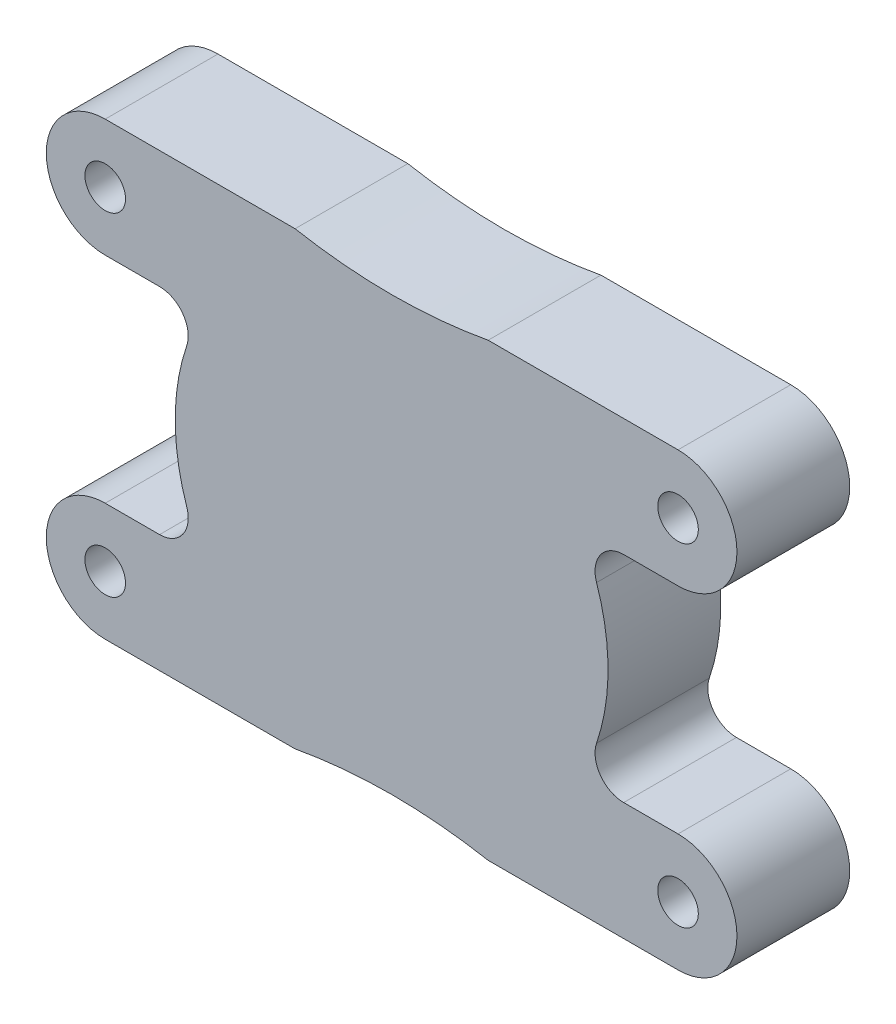
ISO-10303-21;
HEADER;
FILE_DESCRIPTION(('STEP AP214'),'2;1');
FILE_NAME('part.step','',(''),(''),'','','');
FILE_SCHEMA(('AUTOMOTIVE_DESIGN { 1 0 10303 214 1 1 1 1 }'));
ENDSEC;
DATA;
#1=APPLICATION_CONTEXT('core data for automotive mechanical design processes');
#2=APPLICATION_PROTOCOL_DEFINITION('international standard','automotive_design',2000,#1);
#3=PRODUCT_CONTEXT('',#1,'mechanical');
#4=PRODUCT('Part','Part','',(#3));
#5=PRODUCT_RELATED_PRODUCT_CATEGORY('part','',(#4));
#6=PRODUCT_DEFINITION_FORMATION('','',#4);
#7=PRODUCT_DEFINITION_CONTEXT('part definition',#1,'design');
#8=PRODUCT_DEFINITION('design','',#6,#7);
#9=PRODUCT_DEFINITION_SHAPE('','',#8);
#10=(LENGTH_UNIT() NAMED_UNIT(*) SI_UNIT(.MILLI.,.METRE.));
#11=(NAMED_UNIT(*) PLANE_ANGLE_UNIT() SI_UNIT($,.RADIAN.));
#12=(NAMED_UNIT(*) SI_UNIT($,.STERADIAN.) SOLID_ANGLE_UNIT());
#13=UNCERTAINTY_MEASURE_WITH_UNIT(LENGTH_MEASURE(1.E-05),#10,'distance_accuracy_value','');
#14=(GEOMETRIC_REPRESENTATION_CONTEXT(3) GLOBAL_UNCERTAINTY_ASSIGNED_CONTEXT((#13)) GLOBAL_UNIT_ASSIGNED_CONTEXT((#10,
#11,#12)) REPRESENTATION_CONTEXT('',''));
#15=CARTESIAN_POINT('',(0.,0.,0.));
#16=DIRECTION('',(0.,0.,1.));
#17=DIRECTION('',(1.,0.,0.));
#18=AXIS2_PLACEMENT_3D('',#15,#16,#17);
#19=CARTESIAN_POINT('',(0.,-66.4553538573512,10.));
#20=DIRECTION('',(0.,0.,1.));
#21=DIRECTION('',(1.,0.,0.));
#22=AXIS2_PLACEMENT_3D('',#19,#20,#21);
#23=PLANE('',#22);
#24=CARTESIAN_POINT('',(25.4,-14.7499948,10.));
#25=DIRECTION('',(0.,0.,1.));
#26=DIRECTION('',(1.,0.,0.));
#27=AXIS2_PLACEMENT_3D('',#24,#25,#26);
#28=CIRCLE('',#27,1.8);
#29=CARTESIAN_POINT('',(27.2,-14.7499948,10.));
#30=VERTEX_POINT('',#29);
#31=EDGE_CURVE('E460',#30,#30,#28,.T.);
#32=ORIENTED_EDGE('',*,*,#31,.F.);
#33=EDGE_LOOP('',(#32));
#34=FACE_BOUND('',#33,.T.);
#35=CARTESIAN_POINT('',(-25.4,14.7499948,10.));
#36=DIRECTION('',(0.,0.,1.));
#37=DIRECTION('',(1.,0.,0.));
#38=AXIS2_PLACEMENT_3D('',#35,#36,#37);
#39=CIRCLE('',#38,1.8);
#40=CARTESIAN_POINT('',(-23.6,14.7499948,10.));
#41=VERTEX_POINT('',#40);
#42=EDGE_CURVE('E218',#41,#41,#39,.T.);
#43=ORIENTED_EDGE('',*,*,#42,.F.);
#44=EDGE_LOOP('',(#43));
#45=FACE_BOUND('',#44,.T.);
#46=CARTESIAN_POINT('',(0.,-66.4553538573512,10.));
#47=DIRECTION('',(0.,0.,-1.));
#48=DIRECTION('',(1.,0.,0.));
#49=AXIS2_PLACEMENT_3D('',#46,#47,#48);
#50=CIRCLE('',#49,47.2624788573512);
#51=CARTESIAN_POINT('',(-8.56257240819123,-19.9749896,10.));
#52=VERTEX_POINT('',#51);
#53=CARTESIAN_POINT('',(8.56257240819119,-19.9749896,10.));
#54=VERTEX_POINT('',#53);
#55=EDGE_CURVE('E272',#52,#54,#50,.T.);
#56=ORIENTED_EDGE('',*,*,#55,.T.);
#57=DIRECTION('',(1.,0.,0.));
#58=VECTOR('',#57,1.);
#59=CARTESIAN_POINT('',(8.56257240819119,-19.9749896,10.));
#60=LINE('',#59,#58);
#61=CARTESIAN_POINT('',(25.4,-19.9749896,10.));
#62=VERTEX_POINT('',#61);
#63=EDGE_CURVE('E136',#54,#62,#60,.T.);
#64=ORIENTED_EDGE('',*,*,#63,.T.);
#65=CARTESIAN_POINT('',(25.4,-14.7499948,10.));
#66=DIRECTION('',(0.,0.,1.));
#67=DIRECTION('',(1.,0.,0.));
#68=AXIS2_PLACEMENT_3D('',#65,#66,#67);
#69=CIRCLE('',#68,5.2249948);
#70=CARTESIAN_POINT('',(25.4,-9.52500000000001,10.));
#71=VERTEX_POINT('',#70);
#72=EDGE_CURVE('E341',#62,#71,#69,.T.);
#73=ORIENTED_EDGE('',*,*,#72,.T.);
#74=DIRECTION('',(-1.,0.,0.));
#75=VECTOR('',#74,1.);
#76=CARTESIAN_POINT('',(25.4,-9.525,10.));
#77=LINE('',#76,#75);
#78=CARTESIAN_POINT('',(20.5797869465557,-9.525,10.));
#79=VERTEX_POINT('',#78);
#80=EDGE_CURVE('E361',#71,#79,#77,.T.);
#81=ORIENTED_EDGE('',*,*,#80,.T.);
#82=CARTESIAN_POINT('',(20.5797869465557,-6.985,10.));
#83=DIRECTION('',(0.,0.,-1.));
#84=DIRECTION('',(1.,0.,0.));
#85=AXIS2_PLACEMENT_3D('',#82,#83,#84);
#86=CIRCLE('',#85,2.54);
#87=CARTESIAN_POINT('',(18.1745525335178,-6.16863769174581,10.));
#88=VERTEX_POINT('',#87);
#89=EDGE_CURVE('E357',#79,#88,#86,.T.);
#90=ORIENTED_EDGE('',*,*,#89,.T.);
#91=CARTESIAN_POINT('',(0.,0.,10.));
#92=DIRECTION('',(0.,0.,1.));
#93=DIRECTION('',(1.,0.,0.));
#94=AXIS2_PLACEMENT_3D('',#91,#92,#93);
#95=CIRCLE('',#94,19.192875);
#96=CARTESIAN_POINT('',(18.1745525335178,6.16863769174584,10.));
#97=VERTEX_POINT('',#96);
#98=EDGE_CURVE('E360',#88,#97,#95,.T.);
#99=ORIENTED_EDGE('',*,*,#98,.T.);
#100=CARTESIAN_POINT('',(20.5797869465557,6.985,10.));
#101=DIRECTION('',(0.,0.,-1.));
#102=DIRECTION('',(1.,0.,0.));
#103=AXIS2_PLACEMENT_3D('',#100,#101,#102);
#104=CIRCLE('',#103,2.54);
#105=CARTESIAN_POINT('',(20.5797869465555,9.525,10.));
#106=VERTEX_POINT('',#105);
#107=EDGE_CURVE('E365',#97,#106,#104,.T.);
#108=ORIENTED_EDGE('',*,*,#107,.T.);
#109=DIRECTION('',(1.,0.,0.));
#110=VECTOR('',#109,1.);
#111=CARTESIAN_POINT('',(20.5797869465555,9.525,10.));
#112=LINE('',#111,#110);
#113=CARTESIAN_POINT('',(25.4,9.525,10.));
#114=VERTEX_POINT('',#113);
#115=EDGE_CURVE('E372',#106,#114,#112,.T.);
#116=ORIENTED_EDGE('',*,*,#115,.T.);
#117=CARTESIAN_POINT('',(25.4,14.7499948,10.));
#118=DIRECTION('',(0.,0.,1.));
#119=DIRECTION('',(1.,0.,0.));
#120=AXIS2_PLACEMENT_3D('',#117,#118,#119);
#121=CIRCLE('',#120,5.2249948);
#122=CARTESIAN_POINT('',(25.4,19.9749896,10.));
#123=VERTEX_POINT('',#122);
#124=EDGE_CURVE('E375',#114,#123,#121,.T.);
#125=ORIENTED_EDGE('',*,*,#124,.T.);
#126=DIRECTION('',(-1.,0.,0.));
#127=VECTOR('',#126,1.);
#128=CARTESIAN_POINT('',(25.4,19.9749896,10.));
#129=LINE('',#128,#127);
#130=CARTESIAN_POINT('',(8.56257240819117,19.9749896,10.));
#131=VERTEX_POINT('',#130);
#132=EDGE_CURVE('E378',#123,#131,#129,.T.);
#133=ORIENTED_EDGE('',*,*,#132,.T.);
#134=CARTESIAN_POINT('',(0.,66.4553538573512,10.));
#135=DIRECTION('',(0.,0.,-1.));
#136=DIRECTION('',(1.,0.,0.));
#137=AXIS2_PLACEMENT_3D('',#134,#135,#136);
#138=CIRCLE('',#137,47.2624788573512);
#139=CARTESIAN_POINT('',(-8.56257240819127,19.9749896,10.));
#140=VERTEX_POINT('',#139);
#141=EDGE_CURVE('E381',#131,#140,#138,.T.);
#142=ORIENTED_EDGE('',*,*,#141,.T.);
#143=DIRECTION('',(-1.,0.,0.));
#144=VECTOR('',#143,1.);
#145=CARTESIAN_POINT('',(-8.56257240819123,19.9749896,10.));
#146=LINE('',#145,#144);
#147=CARTESIAN_POINT('',(-25.4,19.9749896,10.));
#148=VERTEX_POINT('',#147);
#149=EDGE_CURVE('E384',#140,#148,#146,.T.);
#150=ORIENTED_EDGE('',*,*,#149,.T.);
#151=CARTESIAN_POINT('',(-25.4,14.7499948,10.));
#152=DIRECTION('',(0.,0.,1.));
#153=DIRECTION('',(1.,0.,0.));
#154=AXIS2_PLACEMENT_3D('',#151,#152,#153);
#155=CIRCLE('',#154,5.2249948);
#156=CARTESIAN_POINT('',(-25.4,9.525,10.));
#157=VERTEX_POINT('',#156);
#158=EDGE_CURVE('E387',#148,#157,#155,.T.);
#159=ORIENTED_EDGE('',*,*,#158,.T.);
#160=DIRECTION('',(1.,0.,0.));
#161=VECTOR('',#160,1.);
#162=CARTESIAN_POINT('',(-25.4,9.525,10.));
#163=LINE('',#162,#161);
#164=CARTESIAN_POINT('',(-20.5797869465555,9.525,10.));
#165=VERTEX_POINT('',#164);
#166=EDGE_CURVE('E390',#157,#165,#163,.T.);
#167=ORIENTED_EDGE('',*,*,#166,.T.);
#168=CARTESIAN_POINT('',(-20.5797869465557,6.985,10.));
#169=DIRECTION('',(0.,0.,-1.));
#170=DIRECTION('',(1.,0.,0.));
#171=AXIS2_PLACEMENT_3D('',#168,#169,#170);
#172=CIRCLE('',#171,2.54);
#173=CARTESIAN_POINT('',(-18.1745525335178,6.1686376917458,10.));
#174=VERTEX_POINT('',#173);
#175=EDGE_CURVE('E393',#165,#174,#172,.T.);
#176=ORIENTED_EDGE('',*,*,#175,.T.);
#177=CARTESIAN_POINT('',(0.,0.,10.));
#178=DIRECTION('',(0.,0.,1.));
#179=DIRECTION('',(1.,0.,0.));
#180=AXIS2_PLACEMENT_3D('',#177,#178,#179);
#181=CIRCLE('',#180,19.192875);
#182=CARTESIAN_POINT('',(-18.1745525335178,-6.16863769174583,10.));
#183=VERTEX_POINT('',#182);
#184=EDGE_CURVE('E396',#174,#183,#181,.T.);
#185=ORIENTED_EDGE('',*,*,#184,.T.);
#186=CARTESIAN_POINT('',(-20.5797869465557,-6.985,10.));
#187=DIRECTION('',(0.,0.,-1.));
#188=DIRECTION('',(1.,0.,0.));
#189=AXIS2_PLACEMENT_3D('',#186,#187,#188);
#190=CIRCLE('',#189,2.54);
#191=CARTESIAN_POINT('',(-20.5797869465557,-9.525,10.));
#192=VERTEX_POINT('',#191);
#193=EDGE_CURVE('E191',#183,#192,#190,.T.);
#194=ORIENTED_EDGE('',*,*,#193,.T.);
#195=DIRECTION('',(-1.,0.,0.));
#196=VECTOR('',#195,1.);
#197=CARTESIAN_POINT('',(-20.5797869465557,-9.525,10.));
#198=LINE('',#197,#196);
#199=CARTESIAN_POINT('',(-25.4,-9.52500000000001,10.));
#200=VERTEX_POINT('',#199);
#201=EDGE_CURVE('E185',#192,#200,#198,.T.);
#202=ORIENTED_EDGE('',*,*,#201,.T.);
#203=CARTESIAN_POINT('',(-25.4,-14.7499948,10.));
#204=DIRECTION('',(0.,0.,1.));
#205=DIRECTION('',(1.,0.,0.));
#206=AXIS2_PLACEMENT_3D('',#203,#204,#205);
#207=CIRCLE('',#206,5.2249948);
#208=CARTESIAN_POINT('',(-25.4,-19.9749896,10.));
#209=VERTEX_POINT('',#208);
#210=EDGE_CURVE('E189',#200,#209,#207,.T.);
#211=ORIENTED_EDGE('',*,*,#210,.T.);
#212=DIRECTION('',(1.,0.,0.));
#213=VECTOR('',#212,1.);
#214=CARTESIAN_POINT('',(-25.4,-19.9749896,10.));
#215=LINE('',#214,#213);
#216=EDGE_CURVE('E57',#209,#52,#215,.T.);
#217=ORIENTED_EDGE('',*,*,#216,.T.);
#218=EDGE_LOOP('',(#56,#64,#73,#81,#90,#99,#108,#116,#125,#133,#142,#150,#159,#167,#176,#185,
#194,#202,#211,#217));
#219=FACE_BOUND('',#218,.T.);
#220=CARTESIAN_POINT('',(-25.4,-14.7499948,10.));
#221=DIRECTION('',(0.,0.,1.));
#222=DIRECTION('',(1.,0.,0.));
#223=AXIS2_PLACEMENT_3D('',#220,#221,#222);
#224=CIRCLE('',#223,1.8);
#225=CARTESIAN_POINT('',(-23.6,-14.7499948,10.));
#226=VERTEX_POINT('',#225);
#227=EDGE_CURVE('E468',#226,#226,#224,.T.);
#228=ORIENTED_EDGE('',*,*,#227,.F.);
#229=EDGE_LOOP('',(#228));
#230=FACE_BOUND('',#229,.T.);
#231=CARTESIAN_POINT('',(25.4,14.7499948,10.));
#232=DIRECTION('',(0.,0.,1.));
#233=DIRECTION('',(1.,0.,0.));
#234=AXIS2_PLACEMENT_3D('',#231,#232,#233);
#235=CIRCLE('',#234,1.8);
#236=CARTESIAN_POINT('',(27.2,14.7499948,10.));
#237=VERTEX_POINT('',#236);
#238=EDGE_CURVE('E449',#237,#237,#235,.T.);
#239=ORIENTED_EDGE('',*,*,#238,.F.);
#240=EDGE_LOOP('',(#239));
#241=FACE_BOUND('',#240,.T.);
#242=ADVANCED_FACE('F39',(#34,#45,#219,#230,#241),#23,.T.);
#243=CARTESIAN_POINT('',(0.,-66.4553538573512,0.));
#244=DIRECTION('',(0.,0.,1.));
#245=DIRECTION('',(1.,0.,0.));
#246=AXIS2_PLACEMENT_3D('',#243,#244,#245);
#247=PLANE('',#246);
#248=CARTESIAN_POINT('',(0.,-66.4553538573512,0.));
#249=DIRECTION('',(0.,0.,-1.));
#250=DIRECTION('',(1.,0.,0.));
#251=AXIS2_PLACEMENT_3D('',#248,#249,#250);
#252=CIRCLE('',#251,47.2624788573512);
#253=CARTESIAN_POINT('',(-8.56257240819123,-19.9749896,0.));
#254=VERTEX_POINT('',#253);
#255=CARTESIAN_POINT('',(8.56257240819119,-19.9749896,0.));
#256=VERTEX_POINT('',#255);
#257=EDGE_CURVE('E213',#254,#256,#252,.T.);
#258=ORIENTED_EDGE('',*,*,#257,.F.);
#259=DIRECTION('',(1.,0.,0.));
#260=VECTOR('',#259,1.);
#261=CARTESIAN_POINT('',(-25.4,-19.9749896,0.));
#262=LINE('',#261,#260);
#263=CARTESIAN_POINT('',(-25.4,-19.9749896,0.));
#264=VERTEX_POINT('',#263);
#265=EDGE_CURVE('E128',#264,#254,#262,.T.);
#266=ORIENTED_EDGE('',*,*,#265,.F.);
#267=CARTESIAN_POINT('',(-25.4,-14.7499948,0.));
#268=DIRECTION('',(0.,0.,1.));
#269=DIRECTION('',(1.,0.,0.));
#270=AXIS2_PLACEMENT_3D('',#267,#268,#269);
#271=CIRCLE('',#270,5.2249948);
#272=CARTESIAN_POINT('',(-25.4,-9.52500000000001,0.));
#273=VERTEX_POINT('',#272);
#274=EDGE_CURVE('E122',#273,#264,#271,.T.);
#275=ORIENTED_EDGE('',*,*,#274,.F.);
#276=DIRECTION('',(-1.,0.,0.));
#277=VECTOR('',#276,1.);
#278=CARTESIAN_POINT('',(-20.5797869465557,-9.525,0.));
#279=LINE('',#278,#277);
#280=CARTESIAN_POINT('',(-20.5797869465557,-9.525,0.));
#281=VERTEX_POINT('',#280);
#282=EDGE_CURVE('E200',#281,#273,#279,.T.);
#283=ORIENTED_EDGE('',*,*,#282,.F.);
#284=CARTESIAN_POINT('',(-20.5797869465557,-6.985,0.));
#285=DIRECTION('',(0.,0.,-1.));
#286=DIRECTION('',(1.,0.,0.));
#287=AXIS2_PLACEMENT_3D('',#284,#285,#286);
#288=CIRCLE('',#287,2.54);
#289=CARTESIAN_POINT('',(-18.1745525335178,-6.16863769174583,0.));
#290=VERTEX_POINT('',#289);
#291=EDGE_CURVE('E263',#290,#281,#288,.T.);
#292=ORIENTED_EDGE('',*,*,#291,.F.);
#293=CARTESIAN_POINT('',(0.,0.,0.));
#294=DIRECTION('',(0.,0.,1.));
#295=DIRECTION('',(1.,0.,0.));
#296=AXIS2_PLACEMENT_3D('',#293,#294,#295);
#297=CIRCLE('',#296,19.192875);
#298=CARTESIAN_POINT('',(-18.1745525335178,6.1686376917458,0.));
#299=VERTEX_POINT('',#298);
#300=EDGE_CURVE('E260',#299,#290,#297,.T.);
#301=ORIENTED_EDGE('',*,*,#300,.F.);
#302=CARTESIAN_POINT('',(-20.5797869465557,6.985,0.));
#303=DIRECTION('',(0.,0.,-1.));
#304=DIRECTION('',(1.,0.,0.));
#305=AXIS2_PLACEMENT_3D('',#302,#303,#304);
#306=CIRCLE('',#305,2.54);
#307=CARTESIAN_POINT('',(-20.5797869465555,9.525,0.));
#308=VERTEX_POINT('',#307);
#309=EDGE_CURVE('E257',#308,#299,#306,.T.);
#310=ORIENTED_EDGE('',*,*,#309,.F.);
#311=DIRECTION('',(1.,0.,0.));
#312=VECTOR('',#311,1.);
#313=CARTESIAN_POINT('',(-25.4,9.525,0.));
#314=LINE('',#313,#312);
#315=CARTESIAN_POINT('',(-25.4,9.525,0.));
#316=VERTEX_POINT('',#315);
#317=EDGE_CURVE('E254',#316,#308,#314,.T.);
#318=ORIENTED_EDGE('',*,*,#317,.F.);
#319=CARTESIAN_POINT('',(-25.4,14.7499948,0.));
#320=DIRECTION('',(0.,0.,1.));
#321=DIRECTION('',(1.,0.,0.));
#322=AXIS2_PLACEMENT_3D('',#319,#320,#321);
#323=CIRCLE('',#322,5.2249948);
#324=CARTESIAN_POINT('',(-25.4,19.9749896,0.));
#325=VERTEX_POINT('',#324);
#326=EDGE_CURVE('E251',#325,#316,#323,.T.);
#327=ORIENTED_EDGE('',*,*,#326,.F.);
#328=DIRECTION('',(-1.,0.,0.));
#329=VECTOR('',#328,1.);
#330=CARTESIAN_POINT('',(-8.56257240819123,19.9749896,0.));
#331=LINE('',#330,#329);
#332=CARTESIAN_POINT('',(-8.56257240819127,19.9749896,0.));
#333=VERTEX_POINT('',#332);
#334=EDGE_CURVE('E248',#333,#325,#331,.T.);
#335=ORIENTED_EDGE('',*,*,#334,.F.);
#336=CARTESIAN_POINT('',(0.,66.4553538573512,0.));
#337=DIRECTION('',(0.,0.,-1.));
#338=DIRECTION('',(1.,0.,0.));
#339=AXIS2_PLACEMENT_3D('',#336,#337,#338);
#340=CIRCLE('',#339,47.2624788573512);
#341=CARTESIAN_POINT('',(8.56257240819117,19.9749896,0.));
#342=VERTEX_POINT('',#341);
#343=EDGE_CURVE('E245',#342,#333,#340,.T.);
#344=ORIENTED_EDGE('',*,*,#343,.F.);
#345=DIRECTION('',(-1.,0.,0.));
#346=VECTOR('',#345,1.);
#347=CARTESIAN_POINT('',(25.4,19.9749896,0.));
#348=LINE('',#347,#346);
#349=CARTESIAN_POINT('',(25.4,19.9749896,0.));
#350=VERTEX_POINT('',#349);
#351=EDGE_CURVE('E242',#350,#342,#348,.T.);
#352=ORIENTED_EDGE('',*,*,#351,.F.);
#353=CARTESIAN_POINT('',(25.4,14.7499948,0.));
#354=DIRECTION('',(0.,0.,1.));
#355=DIRECTION('',(1.,0.,0.));
#356=AXIS2_PLACEMENT_3D('',#353,#354,#355);
#357=CIRCLE('',#356,5.2249948);
#358=CARTESIAN_POINT('',(25.4,9.525,0.));
#359=VERTEX_POINT('',#358);
#360=EDGE_CURVE('E239',#359,#350,#357,.T.);
#361=ORIENTED_EDGE('',*,*,#360,.F.);
#362=DIRECTION('',(1.,0.,0.));
#363=VECTOR('',#362,1.);
#364=CARTESIAN_POINT('',(20.5797869465555,9.525,0.));
#365=LINE('',#364,#363);
#366=CARTESIAN_POINT('',(20.5797869465555,9.525,0.));
#367=VERTEX_POINT('',#366);
#368=EDGE_CURVE('E236',#367,#359,#365,.T.);
#369=ORIENTED_EDGE('',*,*,#368,.F.);
#370=CARTESIAN_POINT('',(20.5797869465557,6.985,0.));
#371=DIRECTION('',(0.,0.,-1.));
#372=DIRECTION('',(1.,0.,0.));
#373=AXIS2_PLACEMENT_3D('',#370,#371,#372);
#374=CIRCLE('',#373,2.54);
#375=CARTESIAN_POINT('',(18.1745525335178,6.16863769174584,0.));
#376=VERTEX_POINT('',#375);
#377=EDGE_CURVE('E233',#376,#367,#374,.T.);
#378=ORIENTED_EDGE('',*,*,#377,.F.);
#379=CARTESIAN_POINT('',(0.,0.,0.));
#380=DIRECTION('',(0.,0.,1.));
#381=DIRECTION('',(1.,0.,0.));
#382=AXIS2_PLACEMENT_3D('',#379,#380,#381);
#383=CIRCLE('',#382,19.192875);
#384=CARTESIAN_POINT('',(18.1745525335178,-6.16863769174581,0.));
#385=VERTEX_POINT('',#384);
#386=EDGE_CURVE('E230',#385,#376,#383,.T.);
#387=ORIENTED_EDGE('',*,*,#386,.F.);
#388=CARTESIAN_POINT('',(20.5797869465557,-6.985,0.));
#389=DIRECTION('',(0.,0.,-1.));
#390=DIRECTION('',(1.,0.,0.));
#391=AXIS2_PLACEMENT_3D('',#388,#389,#390);
#392=CIRCLE('',#391,2.54);
#393=CARTESIAN_POINT('',(20.5797869465557,-9.525,0.));
#394=VERTEX_POINT('',#393);
#395=EDGE_CURVE('E227',#394,#385,#392,.T.);
#396=ORIENTED_EDGE('',*,*,#395,.F.);
#397=DIRECTION('',(-1.,0.,0.));
#398=VECTOR('',#397,1.);
#399=CARTESIAN_POINT('',(25.4,-9.525,0.));
#400=LINE('',#399,#398);
#401=CARTESIAN_POINT('',(25.4,-9.52500000000001,0.));
#402=VERTEX_POINT('',#401);
#403=EDGE_CURVE('E224',#402,#394,#400,.T.);
#404=ORIENTED_EDGE('',*,*,#403,.F.);
#405=CARTESIAN_POINT('',(25.4,-14.7499948,0.));
#406=DIRECTION('',(0.,0.,1.));
#407=DIRECTION('',(1.,0.,0.));
#408=AXIS2_PLACEMENT_3D('',#405,#406,#407);
#409=CIRCLE('',#408,5.2249948);
#410=CARTESIAN_POINT('',(25.4,-19.9749896,0.));
#411=VERTEX_POINT('',#410);
#412=EDGE_CURVE('E221',#411,#402,#409,.T.);
#413=ORIENTED_EDGE('',*,*,#412,.F.);
#414=DIRECTION('',(1.,0.,0.));
#415=VECTOR('',#414,1.);
#416=CARTESIAN_POINT('',(8.56257240819119,-19.9749896,0.));
#417=LINE('',#416,#415);
#418=EDGE_CURVE('E217',#256,#411,#417,.T.);
#419=ORIENTED_EDGE('',*,*,#418,.F.);
#420=EDGE_LOOP('',(#258,#266,#275,#283,#292,#301,#310,#318,#327,#335,#344,#352,#361,#369,#378,
#387,#396,#404,#413,#419));
#421=FACE_BOUND('',#420,.T.);
#422=CARTESIAN_POINT('',(-25.4,14.7499948,0.));
#423=DIRECTION('',(0.,0.,1.));
#424=DIRECTION('',(1.,0.,0.));
#425=AXIS2_PLACEMENT_3D('',#422,#423,#424);
#426=CIRCLE('',#425,1.8);
#427=CARTESIAN_POINT('',(-23.6,14.7499948,0.));
#428=VERTEX_POINT('',#427);
#429=EDGE_CURVE('E472',#428,#428,#426,.T.);
#430=ORIENTED_EDGE('',*,*,#429,.T.);
#431=EDGE_LOOP('',(#430));
#432=FACE_BOUND('',#431,.T.);
#433=CARTESIAN_POINT('',(-25.4,-14.7499948,0.));
#434=DIRECTION('',(0.,0.,1.));
#435=DIRECTION('',(1.,0.,0.));
#436=AXIS2_PLACEMENT_3D('',#433,#434,#435);
#437=CIRCLE('',#436,1.8);
#438=CARTESIAN_POINT('',(-23.6,-14.7499948,0.));
#439=VERTEX_POINT('',#438);
#440=EDGE_CURVE('E464',#439,#439,#437,.T.);
#441=ORIENTED_EDGE('',*,*,#440,.T.);
#442=EDGE_LOOP('',(#441));
#443=FACE_BOUND('',#442,.T.);
#444=CARTESIAN_POINT('',(25.4,-14.7499948,0.));
#445=DIRECTION('',(0.,0.,1.));
#446=DIRECTION('',(1.,0.,0.));
#447=AXIS2_PLACEMENT_3D('',#444,#445,#446);
#448=CIRCLE('',#447,1.8);
#449=CARTESIAN_POINT('',(27.2,-14.7499948,0.));
#450=VERTEX_POINT('',#449);
#451=EDGE_CURVE('E457',#450,#450,#448,.T.);
#452=ORIENTED_EDGE('',*,*,#451,.T.);
#453=EDGE_LOOP('',(#452));
#454=FACE_BOUND('',#453,.T.);
#455=CARTESIAN_POINT('',(25.4,14.7499948,0.));
#456=DIRECTION('',(0.,0.,1.));
#457=DIRECTION('',(1.,0.,0.));
#458=AXIS2_PLACEMENT_3D('',#455,#456,#457);
#459=CIRCLE('',#458,1.8);
#460=CARTESIAN_POINT('',(27.2,14.7499948,0.));
#461=VERTEX_POINT('',#460);
#462=EDGE_CURVE('E452',#461,#461,#459,.T.);
#463=ORIENTED_EDGE('',*,*,#462,.T.);
#464=EDGE_LOOP('',(#463));
#465=FACE_BOUND('',#464,.T.);
#466=ADVANCED_FACE('F345',(#421,#432,#443,#454,#465),#247,.F.);
#467=CARTESIAN_POINT('',(0.,-66.4553538573512,10.));
#468=DIRECTION('',(0.,0.,-1.));
#469=DIRECTION('',(-1.,0.,0.));
#470=AXIS2_PLACEMENT_3D('',#467,#468,#469);
#471=CYLINDRICAL_SURFACE('',#470,47.2624788573512);
#472=ORIENTED_EDGE('',*,*,#257,.T.);
#473=DIRECTION('',(0.,0.,-1.));
#474=VECTOR('',#473,1.);
#475=CARTESIAN_POINT('',(8.56257240819119,-19.9749896,10.));
#476=LINE('',#475,#474);
#477=EDGE_CURVE('E11',#54,#256,#476,.T.);
#478=ORIENTED_EDGE('',*,*,#477,.F.);
#479=ORIENTED_EDGE('',*,*,#55,.F.);
#480=DIRECTION('',(0.,0.,-1.));
#481=VECTOR('',#480,1.);
#482=CARTESIAN_POINT('',(-8.56257240819123,-19.9749896,10.));
#483=LINE('',#482,#481);
#484=EDGE_CURVE('E209',#52,#254,#483,.T.);
#485=ORIENTED_EDGE('',*,*,#484,.T.);
#486=EDGE_LOOP('',(#472,#478,#479,#485));
#487=FACE_BOUND('',#486,.T.);
#488=ADVANCED_FACE('F41',(#487),#471,.F.);
#489=CARTESIAN_POINT('',(8.56257240819119,-19.9749896,10.));
#490=DIRECTION('',(0.,1.,0.));
#491=DIRECTION('',(-1.,0.,0.));
#492=AXIS2_PLACEMENT_3D('',#489,#490,#491);
#493=PLANE('',#492);
#494=ORIENTED_EDGE('',*,*,#418,.T.);
#495=DIRECTION('',(0.,0.,-1.));
#496=VECTOR('',#495,1.);
#497=CARTESIAN_POINT('',(25.4,-19.9749896,10.));
#498=LINE('',#497,#496);
#499=EDGE_CURVE('E49',#62,#411,#498,.T.);
#500=ORIENTED_EDGE('',*,*,#499,.F.);
#501=ORIENTED_EDGE('',*,*,#63,.F.);
#502=ORIENTED_EDGE('',*,*,#477,.T.);
#503=EDGE_LOOP('',(#494,#500,#501,#502));
#504=FACE_BOUND('',#503,.T.);
#505=ADVANCED_FACE('F668',(#504),#493,.F.);
#506=CARTESIAN_POINT('',(25.4,-14.7499948,10.));
#507=DIRECTION('',(0.,0.,-1.));
#508=DIRECTION('',(-1.,0.,0.));
#509=AXIS2_PLACEMENT_3D('',#506,#507,#508);
#510=CYLINDRICAL_SURFACE('',#509,5.2249948);
#511=ORIENTED_EDGE('',*,*,#412,.T.);
#512=DIRECTION('',(0.,0.,-1.));
#513=VECTOR('',#512,1.);
#514=CARTESIAN_POINT('',(25.4,-9.52500000000001,10.));
#515=LINE('',#514,#513);
#516=EDGE_CURVE('E331',#71,#402,#515,.T.);
#517=ORIENTED_EDGE('',*,*,#516,.F.);
#518=ORIENTED_EDGE('',*,*,#72,.F.);
#519=ORIENTED_EDGE('',*,*,#499,.T.);
#520=EDGE_LOOP('',(#511,#517,#518,#519));
#521=FACE_BOUND('',#520,.T.);
#522=ADVANCED_FACE('F339',(#521),#510,.T.);
#523=CARTESIAN_POINT('',(25.4,-9.525,10.));
#524=DIRECTION('',(0.,-1.,0.));
#525=DIRECTION('',(1.,0.,0.));
#526=AXIS2_PLACEMENT_3D('',#523,#524,#525);
#527=PLANE('',#526);
#528=ORIENTED_EDGE('',*,*,#403,.T.);
#529=DIRECTION('',(0.,0.,-1.));
#530=VECTOR('',#529,1.);
#531=CARTESIAN_POINT('',(20.5797869465557,-9.525,10.));
#532=LINE('',#531,#530);
#533=EDGE_CURVE('E327',#79,#394,#532,.T.);
#534=ORIENTED_EDGE('',*,*,#533,.F.);
#535=ORIENTED_EDGE('',*,*,#80,.F.);
#536=ORIENTED_EDGE('',*,*,#516,.T.);
#537=EDGE_LOOP('',(#528,#534,#535,#536));
#538=FACE_BOUND('',#537,.T.);
#539=ADVANCED_FACE('F351',(#538),#527,.F.);
#540=CARTESIAN_POINT('',(20.5797869465557,-6.985,10.));
#541=DIRECTION('',(0.,0.,-1.));
#542=DIRECTION('',(-1.,0.,0.));
#543=AXIS2_PLACEMENT_3D('',#540,#541,#542);
#544=CYLINDRICAL_SURFACE('',#543,2.54);
#545=ORIENTED_EDGE('',*,*,#395,.T.);
#546=DIRECTION('',(0.,0.,-1.));
#547=VECTOR('',#546,1.);
#548=CARTESIAN_POINT('',(18.1745525335178,-6.16863769174581,10.));
#549=LINE('',#548,#547);
#550=EDGE_CURVE('E323',#88,#385,#549,.T.);
#551=ORIENTED_EDGE('',*,*,#550,.F.);
#552=ORIENTED_EDGE('',*,*,#89,.F.);
#553=ORIENTED_EDGE('',*,*,#533,.T.);
#554=EDGE_LOOP('',(#545,#551,#552,#553));
#555=FACE_BOUND('',#554,.T.);
#556=ADVANCED_FACE('F355',(#555),#544,.F.);
#557=CARTESIAN_POINT('',(0.,0.,10.));
#558=DIRECTION('',(0.,0.,-1.));
#559=DIRECTION('',(-1.,0.,0.));
#560=AXIS2_PLACEMENT_3D('',#557,#558,#559);
#561=CYLINDRICAL_SURFACE('',#560,19.192875);
#562=ORIENTED_EDGE('',*,*,#386,.T.);
#563=DIRECTION('',(0.,0.,-1.));
#564=VECTOR('',#563,1.);
#565=CARTESIAN_POINT('',(18.1745525335178,6.16863769174584,10.));
#566=LINE('',#565,#564);
#567=EDGE_CURVE('E319',#97,#376,#566,.T.);
#568=ORIENTED_EDGE('',*,*,#567,.F.);
#569=ORIENTED_EDGE('',*,*,#98,.F.);
#570=ORIENTED_EDGE('',*,*,#550,.T.);
#571=EDGE_LOOP('',(#562,#568,#569,#570));
#572=FACE_BOUND('',#571,.T.);
#573=ADVANCED_FACE('F633',(#572),#561,.T.);
#574=CARTESIAN_POINT('',(20.5797869465557,6.985,10.));
#575=DIRECTION('',(0.,0.,-1.));
#576=DIRECTION('',(-1.,0.,0.));
#577=AXIS2_PLACEMENT_3D('',#574,#575,#576);
#578=CYLINDRICAL_SURFACE('',#577,2.54);
#579=ORIENTED_EDGE('',*,*,#377,.T.);
#580=DIRECTION('',(0.,0.,-1.));
#581=VECTOR('',#580,1.);
#582=CARTESIAN_POINT('',(20.5797869465555,9.525,10.));
#583=LINE('',#582,#581);
#584=EDGE_CURVE('E315',#106,#367,#583,.T.);
#585=ORIENTED_EDGE('',*,*,#584,.F.);
#586=ORIENTED_EDGE('',*,*,#107,.F.);
#587=ORIENTED_EDGE('',*,*,#567,.T.);
#588=EDGE_LOOP('',(#579,#585,#586,#587));
#589=FACE_BOUND('',#588,.T.);
#590=ADVANCED_FACE('F623',(#589),#578,.F.);
#591=CARTESIAN_POINT('',(20.5797869465555,9.525,10.));
#592=DIRECTION('',(0.,1.,0.));
#593=DIRECTION('',(-1.,0.,0.));
#594=AXIS2_PLACEMENT_3D('',#591,#592,#593);
#595=PLANE('',#594);
#596=ORIENTED_EDGE('',*,*,#368,.T.);
#597=DIRECTION('',(0.,0.,-1.));
#598=VECTOR('',#597,1.);
#599=CARTESIAN_POINT('',(25.4,9.525,10.));
#600=LINE('',#599,#598);
#601=EDGE_CURVE('E311',#114,#359,#600,.T.);
#602=ORIENTED_EDGE('',*,*,#601,.F.);
#603=ORIENTED_EDGE('',*,*,#115,.F.);
#604=ORIENTED_EDGE('',*,*,#584,.T.);
#605=EDGE_LOOP('',(#596,#602,#603,#604));
#606=FACE_BOUND('',#605,.T.);
#607=ADVANCED_FACE('F613',(#606),#595,.F.);
#608=CARTESIAN_POINT('',(25.4,14.7499948,10.));
#609=DIRECTION('',(0.,0.,-1.));
#610=DIRECTION('',(-1.,0.,0.));
#611=AXIS2_PLACEMENT_3D('',#608,#609,#610);
#612=CYLINDRICAL_SURFACE('',#611,5.2249948);
#613=ORIENTED_EDGE('',*,*,#360,.T.);
#614=DIRECTION('',(0.,0.,-1.));
#615=VECTOR('',#614,1.);
#616=CARTESIAN_POINT('',(25.4,19.9749896,10.));
#617=LINE('',#616,#615);
#618=EDGE_CURVE('E307',#123,#350,#617,.T.);
#619=ORIENTED_EDGE('',*,*,#618,.F.);
#620=ORIENTED_EDGE('',*,*,#124,.F.);
#621=ORIENTED_EDGE('',*,*,#601,.T.);
#622=EDGE_LOOP('',(#613,#619,#620,#621));
#623=FACE_BOUND('',#622,.T.);
#624=ADVANCED_FACE('F603',(#623),#612,.T.);
#625=CARTESIAN_POINT('',(25.4,19.9749896,10.));
#626=DIRECTION('',(0.,-1.,0.));
#627=DIRECTION('',(1.,0.,0.));
#628=AXIS2_PLACEMENT_3D('',#625,#626,#627);
#629=PLANE('',#628);
#630=ORIENTED_EDGE('',*,*,#351,.T.);
#631=DIRECTION('',(0.,0.,-1.));
#632=VECTOR('',#631,1.);
#633=CARTESIAN_POINT('',(8.56257240819117,19.9749896,10.));
#634=LINE('',#633,#632);
#635=EDGE_CURVE('E303',#131,#342,#634,.T.);
#636=ORIENTED_EDGE('',*,*,#635,.F.);
#637=ORIENTED_EDGE('',*,*,#132,.F.);
#638=ORIENTED_EDGE('',*,*,#618,.T.);
#639=EDGE_LOOP('',(#630,#636,#637,#638));
#640=FACE_BOUND('',#639,.T.);
#641=ADVANCED_FACE('F593',(#640),#629,.F.);
#642=CARTESIAN_POINT('',(0.,66.4553538573512,10.));
#643=DIRECTION('',(0.,0.,-1.));
#644=DIRECTION('',(-1.,0.,0.));
#645=AXIS2_PLACEMENT_3D('',#642,#643,#644);
#646=CYLINDRICAL_SURFACE('',#645,47.2624788573512);
#647=ORIENTED_EDGE('',*,*,#343,.T.);
#648=DIRECTION('',(0.,0.,-1.));
#649=VECTOR('',#648,1.);
#650=CARTESIAN_POINT('',(-8.56257240819127,19.9749896,10.));
#651=LINE('',#650,#649);
#652=EDGE_CURVE('E299',#140,#333,#651,.T.);
#653=ORIENTED_EDGE('',*,*,#652,.F.);
#654=ORIENTED_EDGE('',*,*,#141,.F.);
#655=ORIENTED_EDGE('',*,*,#635,.T.);
#656=EDGE_LOOP('',(#647,#653,#654,#655));
#657=FACE_BOUND('',#656,.T.);
#658=ADVANCED_FACE('F583',(#657),#646,.F.);
#659=CARTESIAN_POINT('',(-8.56257240819123,19.9749896,10.));
#660=DIRECTION('',(0.,-1.,0.));
#661=DIRECTION('',(1.,0.,0.));
#662=AXIS2_PLACEMENT_3D('',#659,#660,#661);
#663=PLANE('',#662);
#664=ORIENTED_EDGE('',*,*,#334,.T.);
#665=DIRECTION('',(0.,0.,-1.));
#666=VECTOR('',#665,1.);
#667=CARTESIAN_POINT('',(-25.4,19.9749896,10.));
#668=LINE('',#667,#666);
#669=EDGE_CURVE('E295',#148,#325,#668,.T.);
#670=ORIENTED_EDGE('',*,*,#669,.F.);
#671=ORIENTED_EDGE('',*,*,#149,.F.);
#672=ORIENTED_EDGE('',*,*,#652,.T.);
#673=EDGE_LOOP('',(#664,#670,#671,#672));
#674=FACE_BOUND('',#673,.T.);
#675=ADVANCED_FACE('F573',(#674),#663,.F.);
#676=CARTESIAN_POINT('',(-25.4,14.7499948,10.));
#677=DIRECTION('',(0.,0.,-1.));
#678=DIRECTION('',(-1.,0.,0.));
#679=AXIS2_PLACEMENT_3D('',#676,#677,#678);
#680=CYLINDRICAL_SURFACE('',#679,5.2249948);
#681=ORIENTED_EDGE('',*,*,#326,.T.);
#682=DIRECTION('',(0.,0.,-1.));
#683=VECTOR('',#682,1.);
#684=CARTESIAN_POINT('',(-25.4,9.525,10.));
#685=LINE('',#684,#683);
#686=EDGE_CURVE('E291',#157,#316,#685,.T.);
#687=ORIENTED_EDGE('',*,*,#686,.F.);
#688=ORIENTED_EDGE('',*,*,#158,.F.);
#689=ORIENTED_EDGE('',*,*,#669,.T.);
#690=EDGE_LOOP('',(#681,#687,#688,#689));
#691=FACE_BOUND('',#690,.T.);
#692=ADVANCED_FACE('F563',(#691),#680,.T.);
#693=CARTESIAN_POINT('',(-25.4,9.525,10.));
#694=DIRECTION('',(0.,1.,0.));
#695=DIRECTION('',(0.,0.,1.));
#696=AXIS2_PLACEMENT_3D('',#693,#694,#695);
#697=PLANE('',#696);
#698=ORIENTED_EDGE('',*,*,#317,.T.);
#699=DIRECTION('',(0.,0.,-1.));
#700=VECTOR('',#699,1.);
#701=CARTESIAN_POINT('',(-20.5797869465555,9.525,10.));
#702=LINE('',#701,#700);
#703=EDGE_CURVE('E287',#165,#308,#702,.T.);
#704=ORIENTED_EDGE('',*,*,#703,.F.);
#705=ORIENTED_EDGE('',*,*,#166,.F.);
#706=ORIENTED_EDGE('',*,*,#686,.T.);
#707=EDGE_LOOP('',(#698,#704,#705,#706));
#708=FACE_BOUND('',#707,.T.);
#709=ADVANCED_FACE('F553',(#708),#697,.F.);
#710=CARTESIAN_POINT('',(-20.5797869465557,6.985,10.));
#711=DIRECTION('',(0.,0.,-1.));
#712=DIRECTION('',(-1.,0.,0.));
#713=AXIS2_PLACEMENT_3D('',#710,#711,#712);
#714=CYLINDRICAL_SURFACE('',#713,2.54);
#715=ORIENTED_EDGE('',*,*,#309,.T.);
#716=DIRECTION('',(0.,0.,-1.));
#717=VECTOR('',#716,1.);
#718=CARTESIAN_POINT('',(-18.1745525335178,6.1686376917458,10.));
#719=LINE('',#718,#717);
#720=EDGE_CURVE('E283',#174,#299,#719,.T.);
#721=ORIENTED_EDGE('',*,*,#720,.F.);
#722=ORIENTED_EDGE('',*,*,#175,.F.);
#723=ORIENTED_EDGE('',*,*,#703,.T.);
#724=EDGE_LOOP('',(#715,#721,#722,#723));
#725=FACE_BOUND('',#724,.T.);
#726=ADVANCED_FACE('F544',(#725),#714,.F.);
#727=CARTESIAN_POINT('',(0.,0.,10.));
#728=DIRECTION('',(0.,0.,-1.));
#729=DIRECTION('',(-1.,0.,0.));
#730=AXIS2_PLACEMENT_3D('',#727,#728,#729);
#731=CYLINDRICAL_SURFACE('',#730,19.192875);
#732=ORIENTED_EDGE('',*,*,#300,.T.);
#733=DIRECTION('',(0.,0.,-1.));
#734=VECTOR('',#733,1.);
#735=CARTESIAN_POINT('',(-18.1745525335178,-6.16863769174583,10.));
#736=LINE('',#735,#734);
#737=EDGE_CURVE('E279',#183,#290,#736,.T.);
#738=ORIENTED_EDGE('',*,*,#737,.F.);
#739=ORIENTED_EDGE('',*,*,#184,.F.);
#740=ORIENTED_EDGE('',*,*,#720,.T.);
#741=EDGE_LOOP('',(#732,#738,#739,#740));
#742=FACE_BOUND('',#741,.T.);
#743=ADVANCED_FACE('F404',(#742),#731,.T.);
#744=CARTESIAN_POINT('',(-20.5797869465557,-6.985,10.));
#745=DIRECTION('',(0.,0.,-1.));
#746=DIRECTION('',(-1.,0.,0.));
#747=AXIS2_PLACEMENT_3D('',#744,#745,#746);
#748=CYLINDRICAL_SURFACE('',#747,2.54);
#749=ORIENTED_EDGE('',*,*,#291,.T.);
#750=DIRECTION('',(0.,0.,-1.));
#751=VECTOR('',#750,1.);
#752=CARTESIAN_POINT('',(-20.5797869465557,-9.525,10.));
#753=LINE('',#752,#751);
#754=EDGE_CURVE('E202',#192,#281,#753,.T.);
#755=ORIENTED_EDGE('',*,*,#754,.F.);
#756=ORIENTED_EDGE('',*,*,#193,.F.);
#757=ORIENTED_EDGE('',*,*,#737,.T.);
#758=EDGE_LOOP('',(#749,#755,#756,#757));
#759=FACE_BOUND('',#758,.T.);
#760=ADVANCED_FACE('F408',(#759),#748,.F.);
#761=CARTESIAN_POINT('',(-20.5797869465557,-9.525,10.));
#762=DIRECTION('',(0.,-1.,0.));
#763=DIRECTION('',(1.,0.,0.));
#764=AXIS2_PLACEMENT_3D('',#761,#762,#763);
#765=PLANE('',#764);
#766=ORIENTED_EDGE('',*,*,#282,.T.);
#767=DIRECTION('',(0.,0.,-1.));
#768=VECTOR('',#767,1.);
#769=CARTESIAN_POINT('',(-25.4,-9.52500000000001,10.));
#770=LINE('',#769,#768);
#771=EDGE_CURVE('E197',#200,#273,#770,.T.);
#772=ORIENTED_EDGE('',*,*,#771,.F.);
#773=ORIENTED_EDGE('',*,*,#201,.F.);
#774=ORIENTED_EDGE('',*,*,#754,.T.);
#775=EDGE_LOOP('',(#766,#772,#773,#774));
#776=FACE_BOUND('',#775,.T.);
#777=ADVANCED_FACE('F198',(#776),#765,.F.);
#778=CARTESIAN_POINT('',(-25.4,-14.7499948,10.));
#779=DIRECTION('',(0.,0.,-1.));
#780=DIRECTION('',(-1.,0.,0.));
#781=AXIS2_PLACEMENT_3D('',#778,#779,#780);
#782=CYLINDRICAL_SURFACE('',#781,5.2249948);
#783=ORIENTED_EDGE('',*,*,#274,.T.);
#784=DIRECTION('',(0.,0.,-1.));
#785=VECTOR('',#784,1.);
#786=CARTESIAN_POINT('',(-25.4,-19.9749896,10.));
#787=LINE('',#786,#785);
#788=EDGE_CURVE('E203',#209,#264,#787,.T.);
#789=ORIENTED_EDGE('',*,*,#788,.F.);
#790=ORIENTED_EDGE('',*,*,#210,.F.);
#791=ORIENTED_EDGE('',*,*,#771,.T.);
#792=EDGE_LOOP('',(#783,#789,#790,#791));
#793=FACE_BOUND('',#792,.T.);
#794=ADVANCED_FACE('F205',(#793),#782,.T.);
#795=CARTESIAN_POINT('',(-25.4,-19.9749896,10.));
#796=DIRECTION('',(0.,1.,0.));
#797=DIRECTION('',(0.,0.,1.));
#798=AXIS2_PLACEMENT_3D('',#795,#796,#797);
#799=PLANE('',#798);
#800=ORIENTED_EDGE('',*,*,#265,.T.);
#801=ORIENTED_EDGE('',*,*,#484,.F.);
#802=ORIENTED_EDGE('',*,*,#216,.F.);
#803=ORIENTED_EDGE('',*,*,#788,.T.);
#804=EDGE_LOOP('',(#800,#801,#802,#803));
#805=FACE_BOUND('',#804,.T.);
#806=ADVANCED_FACE('F412',(#805),#799,.F.);
#807=CARTESIAN_POINT('',(-25.4,14.7499948,10.));
#808=DIRECTION('',(0.,0.,-1.));
#809=DIRECTION('',(-1.,0.,0.));
#810=AXIS2_PLACEMENT_3D('',#807,#808,#809);
#811=CYLINDRICAL_SURFACE('',#810,1.8);
#812=ORIENTED_EDGE('',*,*,#42,.T.);
#813=EDGE_LOOP('',(#812));
#814=FACE_BOUND('',#813,.T.);
#815=ORIENTED_EDGE('',*,*,#429,.F.);
#816=EDGE_LOOP('',(#815));
#817=FACE_BOUND('',#816,.T.);
#818=ADVANCED_FACE('F414',(#814,#817),#811,.F.);
#819=CARTESIAN_POINT('',(-25.4,-14.7499948,10.));
#820=DIRECTION('',(0.,0.,-1.));
#821=DIRECTION('',(-1.,0.,0.));
#822=AXIS2_PLACEMENT_3D('',#819,#820,#821);
#823=CYLINDRICAL_SURFACE('',#822,1.8);
#824=ORIENTED_EDGE('',*,*,#227,.T.);
#825=EDGE_LOOP('',(#824));
#826=FACE_BOUND('',#825,.T.);
#827=ORIENTED_EDGE('',*,*,#440,.F.);
#828=EDGE_LOOP('',(#827));
#829=FACE_BOUND('',#828,.T.);
#830=ADVANCED_FACE('F420',(#826,#829),#823,.F.);
#831=CARTESIAN_POINT('',(25.4,-14.7499948,10.));
#832=DIRECTION('',(0.,0.,-1.));
#833=DIRECTION('',(-1.,0.,0.));
#834=AXIS2_PLACEMENT_3D('',#831,#832,#833);
#835=CYLINDRICAL_SURFACE('',#834,1.8);
#836=ORIENTED_EDGE('',*,*,#31,.T.);
#837=EDGE_LOOP('',(#836));
#838=FACE_BOUND('',#837,.T.);
#839=ORIENTED_EDGE('',*,*,#451,.F.);
#840=EDGE_LOOP('',(#839));
#841=FACE_BOUND('',#840,.T.);
#842=ADVANCED_FACE('F436',(#838,#841),#835,.F.);
#843=CARTESIAN_POINT('',(25.4,14.7499948,10.));
#844=DIRECTION('',(0.,0.,-1.));
#845=DIRECTION('',(-1.,0.,0.));
#846=AXIS2_PLACEMENT_3D('',#843,#844,#845);
#847=CYLINDRICAL_SURFACE('',#846,1.8);
#848=ORIENTED_EDGE('',*,*,#238,.T.);
#849=EDGE_LOOP('',(#848));
#850=FACE_BOUND('',#849,.T.);
#851=ORIENTED_EDGE('',*,*,#462,.F.);
#852=EDGE_LOOP('',(#851));
#853=FACE_BOUND('',#852,.T.);
#854=ADVANCED_FACE('F440',(#850,#853),#847,.F.);
#855=CLOSED_SHELL('',(#242,#466,#488,#505,#522,#539,#556,#573,#590,#607,#624,#641,#658,#675,
#692,#709,#726,#743,#760,#777,#794,#806,#818,#830,#842,#854));
#856=MANIFOLD_SOLID_BREP('B2',#855);
#857=ADVANCED_BREP_SHAPE_REPRESENTATION('',(#18,#856),#14);
#858=SHAPE_DEFINITION_REPRESENTATION(#9,#857);
ENDSEC;
END-ISO-10303-21;
